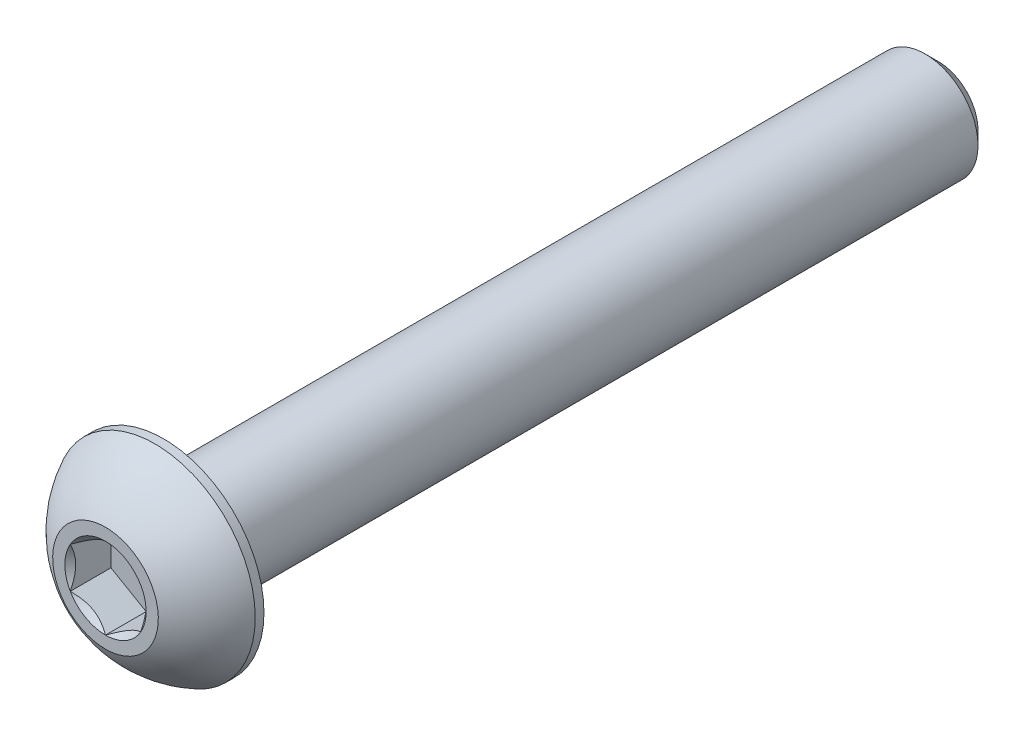
ISO-10303-21;
HEADER;
FILE_DESCRIPTION(('STEP AP214'),'2;1');
FILE_NAME('part.step','',(''),(''),'','','');
FILE_SCHEMA(('AUTOMOTIVE_DESIGN { 1 0 10303 214 1 1 1 1 }'));
ENDSEC;
DATA;
#1=APPLICATION_CONTEXT('core data for automotive mechanical design processes');
#2=APPLICATION_PROTOCOL_DEFINITION('international standard','automotive_design',2000,#1);
#3=PRODUCT_CONTEXT('',#1,'mechanical');
#4=PRODUCT('Part','Part','',(#3));
#5=PRODUCT_RELATED_PRODUCT_CATEGORY('part','',(#4));
#6=PRODUCT_DEFINITION_FORMATION('','',#4);
#7=PRODUCT_DEFINITION_CONTEXT('part definition',#1,'design');
#8=PRODUCT_DEFINITION('design','',#6,#7);
#9=PRODUCT_DEFINITION_SHAPE('','',#8);
#10=(LENGTH_UNIT() NAMED_UNIT(*) SI_UNIT(.MILLI.,.METRE.));
#11=(NAMED_UNIT(*) PLANE_ANGLE_UNIT() SI_UNIT($,.RADIAN.));
#12=(NAMED_UNIT(*) SI_UNIT($,.STERADIAN.) SOLID_ANGLE_UNIT());
#13=UNCERTAINTY_MEASURE_WITH_UNIT(LENGTH_MEASURE(1.E-05),#10,'distance_accuracy_value','');
#14=(GEOMETRIC_REPRESENTATION_CONTEXT(3) GLOBAL_UNCERTAINTY_ASSIGNED_CONTEXT((#13)) GLOBAL_UNIT_ASSIGNED_CONTEXT((#10,
#11,#12)) REPRESENTATION_CONTEXT('',''));
#15=CARTESIAN_POINT('',(0.,0.,0.));
#16=DIRECTION('',(0.,0.,1.));
#17=DIRECTION('',(1.,0.,0.));
#18=AXIS2_PLACEMENT_3D('',#15,#16,#17);
#19=CARTESIAN_POINT('',(0.,-1.5,-23.65));
#20=DIRECTION('',(0.,0.,-1.));
#21=DIRECTION('',(0.,1.,0.));
#22=AXIS2_PLACEMENT_3D('',#19,#20,#21);
#23=PLANE('',#22);
#24=CARTESIAN_POINT('',(0.,0.,-23.65));
#25=DIRECTION('',(0.,0.,-1.));
#26=DIRECTION('',(0.,1.,0.));
#27=AXIS2_PLACEMENT_3D('',#24,#25,#26);
#28=CIRCLE('',#27,1.125);
#29=CARTESIAN_POINT('',(0.,-1.125,-23.65));
#30=VERTEX_POINT('',#29);
#31=EDGE_CURVE('E173',#30,#30,#28,.T.);
#32=ORIENTED_EDGE('',*,*,#31,.T.);
#33=EDGE_LOOP('',(#32));
#34=FACE_BOUND('',#33,.T.);
#35=ADVANCED_FACE('F34',(#34),#23,.T.);
#36=CARTESIAN_POINT('',(0.,0.,-23.65));
#37=DIRECTION('',(0.,0.,-1.));
#38=DIRECTION('',(0.,1.,0.));
#39=AXIS2_PLACEMENT_3D('',#36,#37,#38);
#40=CYLINDRICAL_SURFACE('',#39,1.5);
#41=CARTESIAN_POINT('',(0.,0.,-23.275));
#42=DIRECTION('',(0.,0.,-1.));
#43=DIRECTION('',(0.,1.,0.));
#44=AXIS2_PLACEMENT_3D('',#41,#42,#43);
#45=CIRCLE('',#44,1.5);
#46=CARTESIAN_POINT('',(0.,-1.5,-23.275));
#47=VERTEX_POINT('',#46);
#48=EDGE_CURVE('E47',#47,#47,#45,.F.);
#49=ORIENTED_EDGE('',*,*,#48,.T.);
#50=EDGE_LOOP('',(#49));
#51=FACE_BOUND('',#50,.T.);
#52=CARTESIAN_POINT('',(0.,0.,-1.65));
#53=DIRECTION('',(0.,0.,1.));
#54=DIRECTION('',(1.,0.,0.));
#55=AXIS2_PLACEMENT_3D('',#52,#53,#54);
#56=CIRCLE('',#55,1.5);
#57=CARTESIAN_POINT('',(1.5,0.,-1.65));
#58=VERTEX_POINT('',#57);
#59=EDGE_CURVE('E170',#58,#58,#56,.F.);
#60=ORIENTED_EDGE('',*,*,#59,.T.);
#61=EDGE_LOOP('',(#60));
#62=FACE_BOUND('',#61,.T.);
#63=ADVANCED_FACE('F178',(#51,#62),#40,.T.);
#64=CARTESIAN_POINT('',(0.,0.,-23.65));
#65=DIRECTION('',(0.,0.,1.));
#66=DIRECTION('',(0.,-1.,0.));
#67=AXIS2_PLACEMENT_3D('',#64,#65,#66);
#68=CONICAL_SURFACE('',#67,1.125,0.785398163397452);
#69=CARTESIAN_POINT('',(0.,-1.5,-23.275));
#70=CARTESIAN_POINT('',(0.,-1.49609375,-23.27890625));
#71=CARTESIAN_POINT('',(0.,-1.4921875,-23.2828125));
#72=CARTESIAN_POINT('',(0.,-1.484375,-23.290625));
#73=CARTESIAN_POINT('',(0.,-1.48046875,-23.29453125));
#74=CARTESIAN_POINT('',(0.,-1.47265625,-23.30234375));
#75=CARTESIAN_POINT('',(0.,-1.46875,-23.30625));
#76=CARTESIAN_POINT('',(0.,-1.4609375,-23.3140625));
#77=CARTESIAN_POINT('',(0.,-1.45703125,-23.31796875));
#78=CARTESIAN_POINT('',(0.,-1.44921875,-23.32578125));
#79=CARTESIAN_POINT('',(0.,-1.4453125,-23.3296875));
#80=CARTESIAN_POINT('',(0.,-1.4375,-23.3375));
#81=CARTESIAN_POINT('',(0.,-1.43359375,-23.34140625));
#82=CARTESIAN_POINT('',(0.,-1.42578125,-23.34921875));
#83=CARTESIAN_POINT('',(0.,-1.421875,-23.353125));
#84=CARTESIAN_POINT('',(0.,-1.4140625,-23.3609375));
#85=CARTESIAN_POINT('',(0.,-1.41015625,-23.36484375));
#86=CARTESIAN_POINT('',(0.,-1.40234375,-23.37265625));
#87=CARTESIAN_POINT('',(0.,-1.3984375,-23.3765625));
#88=CARTESIAN_POINT('',(0.,-1.390625,-23.384375));
#89=CARTESIAN_POINT('',(0.,-1.38671875,-23.38828125));
#90=CARTESIAN_POINT('',(0.,-1.37890625,-23.39609375));
#91=CARTESIAN_POINT('',(0.,-1.375,-23.4));
#92=CARTESIAN_POINT('',(0.,-1.3671875,-23.4078125));
#93=CARTESIAN_POINT('',(0.,-1.36328125,-23.41171875));
#94=CARTESIAN_POINT('',(0.,-1.35546875,-23.41953125));
#95=CARTESIAN_POINT('',(0.,-1.3515625,-23.4234375));
#96=CARTESIAN_POINT('',(0.,-1.34375,-23.43125));
#97=CARTESIAN_POINT('',(0.,-1.33984375,-23.43515625));
#98=CARTESIAN_POINT('',(0.,-1.33203125,-23.44296875));
#99=CARTESIAN_POINT('',(0.,-1.328125,-23.446875));
#100=CARTESIAN_POINT('',(0.,-1.3203125,-23.4546875));
#101=CARTESIAN_POINT('',(0.,-1.31640625,-23.45859375));
#102=CARTESIAN_POINT('',(0.,-1.30859375,-23.46640625));
#103=CARTESIAN_POINT('',(0.,-1.3046875,-23.4703125));
#104=CARTESIAN_POINT('',(0.,-1.296875,-23.478125));
#105=CARTESIAN_POINT('',(0.,-1.29296875,-23.48203125));
#106=CARTESIAN_POINT('',(0.,-1.28515625,-23.48984375));
#107=CARTESIAN_POINT('',(0.,-1.28125,-23.49375));
#108=CARTESIAN_POINT('',(0.,-1.2734375,-23.5015625));
#109=CARTESIAN_POINT('',(0.,-1.26953125,-23.50546875));
#110=CARTESIAN_POINT('',(0.,-1.26171875,-23.51328125));
#111=CARTESIAN_POINT('',(0.,-1.2578125,-23.5171875));
#112=CARTESIAN_POINT('',(0.,-1.25,-23.525));
#113=CARTESIAN_POINT('',(0.,-1.24609375,-23.52890625));
#114=CARTESIAN_POINT('',(0.,-1.23828125,-23.53671875));
#115=CARTESIAN_POINT('',(0.,-1.234375,-23.540625));
#116=CARTESIAN_POINT('',(0.,-1.2265625,-23.5484375));
#117=CARTESIAN_POINT('',(0.,-1.22265625,-23.55234375));
#118=CARTESIAN_POINT('',(0.,-1.21484375,-23.56015625));
#119=CARTESIAN_POINT('',(0.,-1.2109375,-23.5640625));
#120=CARTESIAN_POINT('',(0.,-1.203125,-23.571875));
#121=CARTESIAN_POINT('',(0.,-1.19921875,-23.57578125));
#122=CARTESIAN_POINT('',(0.,-1.19140625,-23.58359375));
#123=CARTESIAN_POINT('',(0.,-1.1875,-23.5875));
#124=CARTESIAN_POINT('',(0.,-1.1796875,-23.5953125));
#125=CARTESIAN_POINT('',(0.,-1.17578125,-23.59921875));
#126=CARTESIAN_POINT('',(0.,-1.16796875,-23.60703125));
#127=CARTESIAN_POINT('',(0.,-1.1640625,-23.6109375));
#128=CARTESIAN_POINT('',(0.,-1.15625,-23.61875));
#129=CARTESIAN_POINT('',(0.,-1.15234375,-23.62265625));
#130=CARTESIAN_POINT('',(0.,-1.14453125,-23.63046875));
#131=CARTESIAN_POINT('',(0.,-1.140625,-23.634375));
#132=CARTESIAN_POINT('',(0.,-1.1328125,-23.6421875));
#133=CARTESIAN_POINT('',(0.,-1.12890625,-23.64609375));
#134=CARTESIAN_POINT('',(0.,-1.125,-23.65));
#135=B_SPLINE_CURVE_WITH_KNOTS('',3,(#69,#70,#71,#72,#73,#74,#75,#76,#77,#78,#79,#80,#81,#82,
#83,#84,#85,#86,#87,#88,#89,#90,#91,#92,#93,#94,#95,#96,#97,#98,#99,#100,#101,#102,#103,#104,
#105,#106,#107,#108,#109,#110,#111,#112,#113,#114,#115,#116,#117,#118,#119,#120,#121,#122,#123,
#124,#125,#126,#127,#128,#129,#130,#131,#132,#133,#134),.UNSPECIFIED.,.F.,.F.,(4,2,2,2,2,2,2,2,
2,2,2,2,2,2,2,2,2,2,2,2,2,2,2,2,2,2,2,2,2,2,2,2,4),(0.,0.01657281518406,0.0331456303681199,
0.0497184455521799,0.06629126073624,0.0828640759203,0.09943689110436,0.116009706288418,
0.132582521472477,0.149155336656537,0.165728151840598,0.182300967024658,0.198873782208718,
0.215446597392775,0.232019412576835,0.248592227760895,0.265165042944955,0.281737858129015,
0.298310673313075,0.314883488497135,0.331456303681193,0.348029118865253,0.364601934049313,
0.381174749233373,0.397747564417433,0.414320379601493,0.43089319478555,0.447466009969611,
0.46403882515367,0.48061164033773,0.49718445552179,0.51375727070585,0.530330085889908),.UNSPECIFIED.);
#136=EDGE_CURVE('BSEAM36',#47,#30,#135,.T.);
#137=ORIENTED_EDGE('',*,*,#48,.F.);
#138=ORIENTED_EDGE('',*,*,#31,.F.);
#139=ORIENTED_EDGE('',*,*,#136,.T.);
#140=ORIENTED_EDGE('',*,*,#136,.F.);
#141=EDGE_LOOP('',(#137,#139,#138,#140));
#142=FACE_BOUND('',#141,.T.);
#143=ADVANCED_FACE('F36',(#142),#68,.T.);
#144=CARTESIAN_POINT('',(0.,0.,-2.79483288770053));
#145=DIRECTION('',(0.,0.,1.));
#146=DIRECTION('',(0.,-1.,0.));
#147=AXIS2_PLACEMENT_3D('',#144,#145,#146);
#148=SPHERICAL_SURFACE('',#147,3.17192226735973);
#149=CARTESIAN_POINT('',(0.,0.,0.));
#150=DIRECTION('',(0.,0.,1.));
#151=DIRECTION('',(1.,0.,0.));
#152=AXIS2_PLACEMENT_3D('',#149,#150,#151);
#153=CIRCLE('',#152,1.5);
#154=CARTESIAN_POINT('',(0.,-1.5,0.));
#155=VERTEX_POINT('',#154);
#156=EDGE_CURVE('E167',#155,#155,#153,.T.);
#157=CARTESIAN_POINT('',(0.,0.,-1.4025));
#158=DIRECTION('',(0.,0.,1.));
#159=DIRECTION('',(1.,0.,0.));
#160=AXIS2_PLACEMENT_3D('',#157,#158,#159);
#161=CIRCLE('',#160,2.85);
#162=CARTESIAN_POINT('',(0.,-2.85,-1.4025));
#163=VERTEX_POINT('',#162);
#164=EDGE_CURVE('E161',#163,#163,#161,.T.);
#165=CARTESIAN_POINT('',(0.,-1.5,0.));
#166=CARTESIAN_POINT('',(0.,-1.5181600798921,-0.00974656947336528));
#167=CARTESIAN_POINT('',(0.,-1.53622513742981,-0.0196701847238475));
#168=CARTESIAN_POINT('',(0.,-1.57215840256594,-0.0398676311293121));
#169=CARTESIAN_POINT('',(0.,-1.59002661016438,-0.0501414622842944));
#170=CARTESIAN_POINT('',(0.,-1.6255593701915,-0.0710354648490241));
#171=CARTESIAN_POINT('',(0.,-1.64322392262019,-0.0816556362587714));
#172=CARTESIAN_POINT('',(0.,-1.67834266450262,-0.103238276426967));
#173=CARTESIAN_POINT('',(0.,-1.69579685395636,-0.114200745185416));
#174=CARTESIAN_POINT('',(0.,-1.73048823664554,-0.136463816635606));
#175=CARTESIAN_POINT('',(0.,-1.74772542988099,-0.147764419327347));
#176=CARTESIAN_POINT('',(0.,-1.78197627078176,-0.170699464187153));
#177=CARTESIAN_POINT('',(0.,-1.79898991844709,-0.182333906355219));
#178=CARTESIAN_POINT('',(0.,-1.83278720341135,-0.205932209546912));
#179=CARTESIAN_POINT('',(0.,-1.84957084071028,-0.21789607057054));
#180=CARTESIAN_POINT('',(0.,-1.88290172764636,-0.242148665498754));
#181=CARTESIAN_POINT('',(0.,-1.89944897728351,-0.254437399403341));
#182=CARTESIAN_POINT('',(0.,-1.93230080139369,-0.279335070725423));
#183=CARTESIAN_POINT('',(0.,-1.94860537586673,-0.291944008142919));
#184=CARTESIAN_POINT('',(0.,-1.98096565436365,-0.317477295441111));
#185=CARTESIAN_POINT('',(0.,-1.99702135838753,-0.330401645321807));
#186=CARTESIAN_POINT('',(0.,-2.02887779526297,-0.356560846652225));
#187=CARTESIAN_POINT('',(0.,-2.04467852811452,-0.369795698101948));
#188=CARTESIAN_POINT('',(0.,-2.07601901880464,-0.396570873693307));
#189=CARTESIAN_POINT('',(0.,-2.09155877664321,-0.410111197834942));
#190=CARTESIAN_POINT('',(0.,-2.12237141262985,-0.437492173862106));
#191=CARTESIAN_POINT('',(0.,-2.13764429077792,-0.451332825747633));
#192=CARTESIAN_POINT('',(0.,-2.16791736411296,-0.479309198198268));
#193=CARTESIAN_POINT('',(0.,-2.18291755929993,-0.493444918763374));
#194=CARTESIAN_POINT('',(0.,-2.21263956705415,-0.52200605739095));
#195=CARTESIAN_POINT('',(0.,-2.22736137962139,-0.536431475453418));
#196=CARTESIAN_POINT('',(0.,-2.2565210282552,-0.56556652781647));
#197=CARTESIAN_POINT('',(0.,-2.27095886432178,-0.580276162117054));
#198=CARTESIAN_POINT('',(0.,-2.2995450739765,-0.609974057702794));
#199=CARTESIAN_POINT('',(0.,-2.31369344756465,-0.624962318987951));
#200=CARTESIAN_POINT('',(0.,-2.34169535627252,-0.655211773418758));
#201=CARTESIAN_POINT('',(0.,-2.35554889139224,-0.670472966564409));
#202=CARTESIAN_POINT('',(0.,-2.38295585920366,-0.701262485885582));
#203=CARTESIAN_POINT('',(0.,-2.39650929189537,-0.716790812061104));
#204=CARTESIAN_POINT('',(0.,-2.42331090492182,-0.748108697108241));
#205=CARTESIAN_POINT('',(0.,-2.43655908525656,-0.763898255979857));
#206=CARTESIAN_POINT('',(0.,-2.46274515962755,-0.795732606824226));
#207=CARTESIAN_POINT('',(0.,-2.47568305366379,-0.811777398796979));
#208=CARTESIAN_POINT('',(0.,-2.50124363939651,-0.844116119267125));
#209=CARTESIAN_POINT('',(0.,-2.51386633109298,-0.860410047764518));
#210=CARTESIAN_POINT('',(0.,-2.53879171587278,-0.893240850042598));
#211=CARTESIAN_POINT('',(0.,-2.55109440895612,-0.909777723823286));
#212=CARTESIAN_POINT('',(0.,-2.57537512182785,-0.943088133113639));
#213=CARTESIAN_POINT('',(0.,-2.58735314161625,-0.959861668623304));
#214=CARTESIAN_POINT('',(0.,-2.61097995657956,-0.993639027894245));
#215=CARTESIAN_POINT('',(0.,-2.62262875175448,-1.01064285165552));
#216=CARTESIAN_POINT('',(0.,-2.64559269128198,-1.04487432644225));
#217=CARTESIAN_POINT('',(0.,-2.65690783563458,-1.06210197746771));
#218=CARTESIAN_POINT('',(0.,-2.67920017403639,-1.09677456077299));
#219=CARTESIAN_POINT('',(0.,-2.69017736808561,-1.11421949305282));
#220=CARTESIAN_POINT('',(0.,-2.711789634999,-1.14932001019995));
#221=CARTESIAN_POINT('',(0.,-2.72242470786316,-1.16697559506725));
#222=CARTESIAN_POINT('',(0.,-2.74334869082118,-1.20249070903942));
#223=CARTESIAN_POINT('',(0.,-2.75363760091502,-1.22035023814429));
#224=CARTESIAN_POINT('',(0.,-2.77386535089241,-1.25626645340824));
#225=CARTESIAN_POINT('',(0.,-2.78380419077596,-1.27432313956732));
#226=CARTESIAN_POINT('',(0.,-2.80332801615778,-1.31062681184411));
#227=CARTESIAN_POINT('',(0.,-2.81291300165605,-1.32887379796182));
#228=CARTESIAN_POINT('',(0.,-2.83172550494215,-1.3655511220839));
#229=CARTESIAN_POINT('',(0.,-2.84095302272998,-1.38398146008827));
#230=CARTESIAN_POINT('',(0.,-2.85,-1.4025));
#231=B_SPLINE_CURVE_WITH_KNOTS('',3,(#165,#166,#167,#168,#169,#170,#171,#172,#173,#174,#175,
#176,#177,#178,#179,#180,#181,#182,#183,#184,#185,#186,#187,#188,#189,#190,#191,#192,#193,#194,
#195,#196,#197,#198,#199,#200,#201,#202,#203,#204,#205,#206,#207,#208,#209,#210,#211,#212,#213,
#214,#215,#216,#217,#218,#219,#220,#221,#222,#223,#224,#225,#226,#227,#228,#229,#230),
.UNSPECIFIED.,.F.,.F.,(4,2,2,2,2,2,2,2,2,2,2,2,2,2,2,2,2,2,2,2,2,2,2,2,2,2,2,2,2,2,2,2,4),(0.,
0.0618298941826979,0.123659788365397,0.185489682548095,0.247319576730792,0.309149470913491,
0.370979365096189,0.432809259278888,0.494639153461586,0.556469047644284,0.618298941826982,
0.68012883600968,0.741958730192378,0.803788624375077,0.865618518557775,0.927448412740473,
0.989278306923171,1.05110820110587,1.11293809528857,1.17476798947127,1.23659788365396,
1.29842777783666,1.36025767201936,1.42208756620206,1.48391746038476,1.54574735456745,
1.60757724875015,1.66940714293285,1.73123703711555,1.79306693129825,1.85489682548095,
1.91672671966364,1.97855661384634),.UNSPECIFIED.);
#232=EDGE_CURVE('BSEAM183',#155,#163,#231,.T.);
#233=ORIENTED_EDGE('',*,*,#156,.F.);
#234=ORIENTED_EDGE('',*,*,#164,.T.);
#235=ORIENTED_EDGE('',*,*,#232,.T.);
#236=ORIENTED_EDGE('',*,*,#232,.F.);
#237=EDGE_LOOP('',(#233,#235,#234,#236));
#238=FACE_BOUND('',#237,.T.);
#239=ADVANCED_FACE('F183',(#238),#148,.T.);
#240=CARTESIAN_POINT('',(0.,-1.5,0.));
#241=DIRECTION('',(0.,0.,-1.));
#242=DIRECTION('',(-1.,0.,0.));
#243=AXIS2_PLACEMENT_3D('',#240,#241,#242);
#244=PLANE('',#243);
#245=CARTESIAN_POINT('',(0.,0.,0.));
#246=DIRECTION('',(0.,0.,1.));
#247=DIRECTION('',(1.,0.,0.));
#248=AXIS2_PLACEMENT_3D('',#245,#246,#247);
#249=CIRCLE('',#248,1.15470053837925);
#250=CARTESIAN_POINT('',(-1.,0.577350269189626,0.));
#251=VERTEX_POINT('',#250);
#252=CARTESIAN_POINT('',(-1.,-0.577350269189626,0.));
#253=VERTEX_POINT('',#252);
#254=EDGE_CURVE('E60',#251,#253,#249,.T.);
#255=ORIENTED_EDGE('',*,*,#254,.F.);
#256=CARTESIAN_POINT('',(0.,1.15470053837925,0.));
#257=VERTEX_POINT('',#256);
#258=EDGE_CURVE('E132',#257,#251,#249,.T.);
#259=ORIENTED_EDGE('',*,*,#258,.F.);
#260=CARTESIAN_POINT('',(1.,0.577350269189626,0.));
#261=VERTEX_POINT('',#260);
#262=EDGE_CURVE('E129',#261,#257,#249,.T.);
#263=ORIENTED_EDGE('',*,*,#262,.F.);
#264=CARTESIAN_POINT('',(1.,-0.577350269189626,0.));
#265=VERTEX_POINT('',#264);
#266=EDGE_CURVE('E100',#265,#261,#249,.T.);
#267=ORIENTED_EDGE('',*,*,#266,.F.);
#268=CARTESIAN_POINT('',(0.,-1.15470053837925,0.));
#269=VERTEX_POINT('',#268);
#270=EDGE_CURVE('E92',#269,#265,#249,.T.);
#271=ORIENTED_EDGE('',*,*,#270,.F.);
#272=EDGE_CURVE('E53',#253,#269,#249,.T.);
#273=ORIENTED_EDGE('',*,*,#272,.F.);
#274=EDGE_LOOP('',(#255,#259,#263,#267,#271,#273));
#275=FACE_BOUND('',#274,.T.);
#276=ORIENTED_EDGE('',*,*,#156,.T.);
#277=EDGE_LOOP('',(#276));
#278=FACE_BOUND('',#277,.T.);
#279=ADVANCED_FACE('F126',(#275,#278),#244,.F.);
#280=CARTESIAN_POINT('',(0.,-2.85,-1.65));
#281=DIRECTION('',(0.,0.,1.));
#282=DIRECTION('',(1.,0.,0.));
#283=AXIS2_PLACEMENT_3D('',#280,#281,#282);
#284=PLANE('',#283);
#285=ORIENTED_EDGE('',*,*,#59,.F.);
#286=EDGE_LOOP('',(#285));
#287=FACE_BOUND('',#286,.T.);
#288=CARTESIAN_POINT('',(0.,0.,-1.65));
#289=DIRECTION('',(0.,0.,1.));
#290=DIRECTION('',(1.,0.,0.));
#291=AXIS2_PLACEMENT_3D('',#288,#289,#290);
#292=CIRCLE('',#291,2.85);
#293=CARTESIAN_POINT('',(2.85,0.,-1.65));
#294=VERTEX_POINT('',#293);
#295=EDGE_CURVE('E164',#294,#294,#292,.T.);
#296=ORIENTED_EDGE('',*,*,#295,.F.);
#297=EDGE_LOOP('',(#296));
#298=FACE_BOUND('',#297,.T.);
#299=ADVANCED_FACE('F197',(#287,#298),#284,.F.);
#300=CARTESIAN_POINT('',(0.,0.,0.));
#301=DIRECTION('',(0.,0.,1.));
#302=DIRECTION('',(1.,0.,0.));
#303=AXIS2_PLACEMENT_3D('',#300,#301,#302);
#304=CYLINDRICAL_SURFACE('',#303,2.85);
#305=ORIENTED_EDGE('',*,*,#164,.F.);
#306=EDGE_LOOP('',(#305));
#307=FACE_BOUND('',#306,.T.);
#308=ORIENTED_EDGE('',*,*,#295,.T.);
#309=EDGE_LOOP('',(#308));
#310=FACE_BOUND('',#309,.T.);
#311=ADVANCED_FACE('F200',(#307,#310),#304,.T.);
#312=CARTESIAN_POINT('',(0.,0.,0.));
#313=DIRECTION('',(0.,0.,1.));
#314=DIRECTION('',(1.,0.,0.));
#315=AXIS2_PLACEMENT_3D('',#312,#313,#314);
#316=CONICAL_SURFACE('',#315,1.15470053837925,0.78539816339745);
#317=ORIENTED_EDGE('',*,*,#266,.T.);
#318=CARTESIAN_POINT('',(1.,-1.15147208646462,0.37038567751386));
#319=CARTESIAN_POINT('',(1.,-1.12343447988552,0.349219919873711));
#320=CARTESIAN_POINT('',(1.,-1.09524064850697,0.328261692175909));
#321=CARTESIAN_POINT('',(1.,-1.03847715644376,0.28684602223562));
#322=CARTESIAN_POINT('',(1.,-1.00990740382975,0.266388706123658));
#323=CARTESIAN_POINT('',(1.,-0.923120894333476,0.205604794954508));
#324=CARTESIAN_POINT('',(1.,-0.864253173759059,0.166192228961397));
#325=CARTESIAN_POINT('',(1.,-0.740809858258045,0.0888206642002041));
#326=CARTESIAN_POINT('',(1.,-0.676100255137807,0.0510730391143413));
#327=CARTESIAN_POINT('',(1.,-0.543448939049124,-0.0179754124487091));
#328=CARTESIAN_POINT('',(1.,-0.475519112027778,-0.0492979721531354));
#329=CARTESIAN_POINT('',(1.,-0.373555850333528,-0.0876182211162059));
#330=CARTESIAN_POINT('',(1.,-0.341031989670907,-0.0986164083578445));
#331=CARTESIAN_POINT('',(1.,-0.275199079052293,-0.11800165785264));
#332=CARTESIAN_POINT('',(1.,-0.241889975173933,-0.126388540223302));
#333=CARTESIAN_POINT('',(1.,-0.175247517042992,-0.139974779280984));
#334=CARTESIAN_POINT('',(1.,-0.141925568218174,-0.145229209232033));
#335=CARTESIAN_POINT('',(1.,-0.0749144362322786,-0.152451313429108));
#336=CARTESIAN_POINT('',(1.,-0.0412251978501615,-0.154418486389493));
#337=CARTESIAN_POINT('',(1.,0.0249580992634212,-0.15491680160684));
#338=CARTESIAN_POINT('',(1.,0.0574512826460394,-0.153569732111366));
#339=CARTESIAN_POINT('',(1.,0.122148505701867,-0.147783515501016));
#340=CARTESIAN_POINT('',(1.,0.154352610132927,-0.143345079338465));
#341=CARTESIAN_POINT('',(1.,0.21879989886764,-0.131543169854797));
#342=CARTESIAN_POINT('',(1.,0.251033743268954,-0.124129458961492));
#343=CARTESIAN_POINT('',(1.,0.314797132354919,-0.106771057501325));
#344=CARTESIAN_POINT('',(1.,0.346326735731005,-0.096826578711171));
#345=CARTESIAN_POINT('',(1.,0.445594187730205,-0.061776517445664));
#346=CARTESIAN_POINT('',(1.,0.511919139476037,-0.0326791416432762));
#347=CARTESIAN_POINT('',(1.,0.641453244657532,0.032015329686504));
#348=CARTESIAN_POINT('',(1.,0.704650133126344,0.0676357767152409));
#349=CARTESIAN_POINT('',(1.,0.825428490174987,0.141123901346934));
#350=CARTESIAN_POINT('',(1.,0.883132947867685,0.178791947135463));
#351=CARTESIAN_POINT('',(1.,0.968148853704565,0.237022852943162));
#352=CARTESIAN_POINT('',(1.,0.996120570380285,0.256638475762855));
#353=CARTESIAN_POINT('',(1.,1.05168177729901,0.29638851706127));
#354=CARTESIAN_POINT('',(1.,1.079271369977,0.316522792198831));
#355=CARTESIAN_POINT('',(1.,1.10670185346329,0.336872119072971));
#356=B_SPLINE_CURVE_WITH_KNOTS('',3,(#318,#319,#320,#321,#322,#323,#324,#325,#326,#327,#328,
#329,#330,#331,#332,#333,#334,#335,#336,#337,#338,#339,#340,#341,#342,#343,#344,#345,#346,#347,
#348,#349,#350,#351,#352,#353,#354,#355),.UNSPECIFIED.,.F.,.F.,(4,2,2,2,2,2,2,2,2,2,2,2,2,2,2,2,
2,2,4),(0.,0.105386459083291,0.210799187330124,0.423233611565468,0.647793540908503,
0.871580877738609,0.97449307418142,1.07741235827201,1.17846428203205,1.27953161415762,
1.3769408673961,1.47432772585408,1.57343322804293,1.67253043972851,1.88917353996827,
2.10660791038813,2.31323734249843,2.41572589232044,2.51818641476503),.UNSPECIFIED.);
#357=EDGE_CURVE('E11',#265,#261,#356,.T.);
#358=ORIENTED_EDGE('',*,*,#357,.F.);
#359=EDGE_LOOP('',(#317,#358));
#360=FACE_BOUND('',#359,.T.);
#361=ADVANCED_FACE('F104',(#360),#316,.F.);
#362=ORIENTED_EDGE('',*,*,#262,.T.);
#363=CARTESIAN_POINT('',(1.0002,0.577234799135788,0.00011548737261379));
#364=CARTESIAN_POINT('',(0.965817404992819,0.597085599618622,-0.0197220691742672));
#365=CARTESIAN_POINT('',(0.930859881860175,0.617268335009457,-0.0383949793611113));
#366=CARTESIAN_POINT('',(0.85957719704391,0.658423412276686,-0.0725852572768423));
#367=CARTESIAN_POINT('',(0.823245249471016,0.67939967198808,-0.0880835909765416));
#368=CARTESIAN_POINT('',(0.749983386196689,0.721697428470847,-0.114632692857735));
#369=CARTESIAN_POINT('',(0.713072148554586,0.743008141459637,-0.125750226003074));
#370=CARTESIAN_POINT('',(0.638437270689141,0.786098608286186,-0.142880134223818));
#371=CARTESIAN_POINT('',(0.600715911891364,0.807877044942281,-0.148905302533328));
#372=CARTESIAN_POINT('',(0.535707801582067,0.845409494928863,-0.154339445032507));
#373=CARTESIAN_POINT('',(0.508505628471828,0.861114676896602,-0.155143061683268));
#374=CARTESIAN_POINT('',(0.454153959330888,0.892494627706029,-0.153793300583113));
#375=CARTESIAN_POINT('',(0.427004476245124,0.908169389073954,-0.151639270452801));
#376=CARTESIAN_POINT('',(0.34594372267304,0.954969836969511,-0.140883027871529));
#377=CARTESIAN_POINT('',(0.292435859021573,0.985862616452447,-0.127985443584644));
#378=CARTESIAN_POINT('',(0.198523934856568,1.04008269114923,-0.0968592693978228));
#379=CARTESIAN_POINT('',(0.157679476328165,1.06366425027551,-0.0802622022981607));
#380=CARTESIAN_POINT('',(0.0775903626180559,1.1099037216352,-0.0428750753147074));
#381=CARTESIAN_POINT('',(0.0383409891295618,1.1325643579843,-0.0220986581825969));
#382=CARTESIAN_POINT('',(-0.000200000000000448,1.15481600843309,0.000115487372613952));
#383=B_SPLINE_CURVE_WITH_KNOTS('',3,(#363,#364,#365,#366,#367,#368,#369,#370,#371,#372,#373,
#374,#375,#376,#377,#378,#379,#380,#381,#382),.UNSPECIFIED.,.F.,.F.,(4,2,2,2,2,2,2,2,2,4),(0.,
0.133237676828559,0.26725222983449,0.3991370762693,0.530689603280768,0.624814864263846,
0.718960890149133,0.907306626112097,1.05710100361789,1.20641411519286),.UNSPECIFIED.);
#384=EDGE_CURVE('E131',#261,#257,#383,.T.);
#385=ORIENTED_EDGE('',*,*,#384,.F.);
#386=EDGE_LOOP('',(#362,#385));
#387=FACE_BOUND('',#386,.T.);
#388=ADVANCED_FACE('F280',(#387),#316,.F.);
#389=ORIENTED_EDGE('',*,*,#258,.T.);
#390=CARTESIAN_POINT('',(0.000199999999999653,1.15481600843309,0.000115487372613877));
#391=CARTESIAN_POINT('',(-0.034182595007181,1.13496520795026,-0.0197220691742673));
#392=CARTESIAN_POINT('',(-0.0691401181398251,1.11478247255942,-0.0383949793611114));
#393=CARTESIAN_POINT('',(-0.14042280295609,1.07362739529219,-0.0725852572768422));
#394=CARTESIAN_POINT('',(-0.176754750528985,1.0526511355808,-0.0880835909765414));
#395=CARTESIAN_POINT('',(-0.250016613803312,1.01035337909803,-0.114632692857735));
#396=CARTESIAN_POINT('',(-0.286927851445415,0.989042666109241,-0.125750226003074));
#397=CARTESIAN_POINT('',(-0.36156272931086,0.945952199282691,-0.142880134223818));
#398=CARTESIAN_POINT('',(-0.399284088108636,0.924173762626596,-0.148905302533328));
#399=CARTESIAN_POINT('',(-0.464292198417934,0.886641312640014,-0.154339445032506));
#400=CARTESIAN_POINT('',(-0.491494371528172,0.870936130672275,-0.155143061683268));
#401=CARTESIAN_POINT('',(-0.545846040669112,0.839556179862848,-0.153793300583113));
#402=CARTESIAN_POINT('',(-0.572995523754876,0.823881418494923,-0.151639270452801));
#403=CARTESIAN_POINT('',(-0.65405627732696,0.777080970599367,-0.140883027871529));
#404=CARTESIAN_POINT('',(-0.707564140978428,0.74618819111643,-0.127985443584644));
#405=CARTESIAN_POINT('',(-0.801476065143432,0.691968116419649,-0.096859269397823));
#406=CARTESIAN_POINT('',(-0.842320523671834,0.668386557293371,-0.0802622022981609));
#407=CARTESIAN_POINT('',(-0.922409637381944,0.622147085933681,-0.0428750753147075));
#408=CARTESIAN_POINT('',(-0.961659010870438,0.599486449584575,-0.0220986581825969));
#409=CARTESIAN_POINT('',(-1.0002,0.577234799135788,0.000115487372613623));
#410=B_SPLINE_CURVE_WITH_KNOTS('',3,(#390,#391,#392,#393,#394,#395,#396,#397,#398,#399,#400,
#401,#402,#403,#404,#405,#406,#407,#408,#409),.UNSPECIFIED.,.F.,.F.,(4,2,2,2,2,2,2,2,2,4),(0.,
0.133237676828559,0.26725222983449,0.3991370762693,0.530689603280768,0.624814864263846,
0.718960890149133,0.907306626112098,1.05710100361789,1.20641411519286),.UNSPECIFIED.);
#411=EDGE_CURVE('E136',#257,#251,#410,.T.);
#412=ORIENTED_EDGE('',*,*,#411,.F.);
#413=EDGE_LOOP('',(#389,#412));
#414=FACE_BOUND('',#413,.T.);
#415=ADVANCED_FACE('F139',(#414),#316,.F.);
#416=ORIENTED_EDGE('',*,*,#254,.T.);
#417=CARTESIAN_POINT('',(-1.,-1.15147208646462,0.370385677513861));
#418=CARTESIAN_POINT('',(-1.,-1.12343447988552,0.349219919873711));
#419=CARTESIAN_POINT('',(-1.,-1.09524064850697,0.328261692175909));
#420=CARTESIAN_POINT('',(-1.,-1.03847715644376,0.286846022235621));
#421=CARTESIAN_POINT('',(-1.,-1.00990740382975,0.266388706123658));
#422=CARTESIAN_POINT('',(-1.,-0.923120894333477,0.205604794954509));
#423=CARTESIAN_POINT('',(-1.,-0.86425317375906,0.166192228961397));
#424=CARTESIAN_POINT('',(-1.,-0.740809858258046,0.0888206642002046));
#425=CARTESIAN_POINT('',(-1.,-0.676100255137807,0.0510730391143418));
#426=CARTESIAN_POINT('',(-1.,-0.543448939049125,-0.0179754124487088));
#427=CARTESIAN_POINT('',(-1.,-0.475519112027779,-0.0492979721531352));
#428=CARTESIAN_POINT('',(-1.,-0.373555850333529,-0.0876182211162059));
#429=CARTESIAN_POINT('',(-1.,-0.341031989670908,-0.0986164083578445));
#430=CARTESIAN_POINT('',(-1.,-0.275199079052293,-0.11800165785264));
#431=CARTESIAN_POINT('',(-1.,-0.241889975173933,-0.126388540223302));
#432=CARTESIAN_POINT('',(-1.,-0.175247517042993,-0.139974779280984));
#433=CARTESIAN_POINT('',(-1.,-0.141925568218175,-0.145229209232033));
#434=CARTESIAN_POINT('',(-1.,-0.074914436232279,-0.152451313429108));
#435=CARTESIAN_POINT('',(-1.,-0.0412251978501618,-0.154418486389493));
#436=CARTESIAN_POINT('',(-1.,0.0249580992634209,-0.15491680160684));
#437=CARTESIAN_POINT('',(-1.,0.0574512826460391,-0.153569732111367));
#438=CARTESIAN_POINT('',(-1.,0.122148505701867,-0.147783515501016));
#439=CARTESIAN_POINT('',(-1.,0.154352610132926,-0.143345079338465));
#440=CARTESIAN_POINT('',(-1.,0.21879989886764,-0.131543169854797));
#441=CARTESIAN_POINT('',(-1.,0.251033743268953,-0.124129458961492));
#442=CARTESIAN_POINT('',(-1.,0.314797132354919,-0.106771057501325));
#443=CARTESIAN_POINT('',(-1.,0.346326735731004,-0.0968265787111712));
#444=CARTESIAN_POINT('',(-1.,0.445594187730205,-0.0617765174456643));
#445=CARTESIAN_POINT('',(-1.,0.511919139476036,-0.0326791416432765));
#446=CARTESIAN_POINT('',(-1.,0.641453244657531,0.0320153296865035));
#447=CARTESIAN_POINT('',(-1.,0.704650133126343,0.0676357767152402));
#448=CARTESIAN_POINT('',(-1.,0.825428490174986,0.141123901346934));
#449=CARTESIAN_POINT('',(-1.,0.883132947867684,0.178791947135462));
#450=CARTESIAN_POINT('',(-1.,0.968148853704564,0.237022852943162));
#451=CARTESIAN_POINT('',(-1.,0.996120570380284,0.256638475762855));
#452=CARTESIAN_POINT('',(-1.,1.05168177729901,0.296388517061269));
#453=CARTESIAN_POINT('',(-1.,1.079271369977,0.31652279219883));
#454=CARTESIAN_POINT('',(-1.,1.10670185346329,0.33687211907297));
#455=B_SPLINE_CURVE_WITH_KNOTS('',3,(#417,#418,#419,#420,#421,#422,#423,#424,#425,#426,#427,
#428,#429,#430,#431,#432,#433,#434,#435,#436,#437,#438,#439,#440,#441,#442,#443,#444,#445,#446,
#447,#448,#449,#450,#451,#452,#453,#454),.UNSPECIFIED.,.F.,.F.,(4,2,2,2,2,2,2,2,2,2,2,2,2,2,2,2,
2,2,4),(0.,0.105386459083291,0.210799187330125,0.423233611565469,0.647793540908503,
0.87158087773861,0.974493074181421,1.07741235827201,1.17846428203205,1.27953161415762,
1.3769408673961,1.47432772585408,1.57343322804293,1.67253043972851,1.88917353996827,
2.10660791038813,2.31323734249843,2.41572589232044,2.51818641476503),.UNSPECIFIED.);
#456=EDGE_CURVE('E143',#251,#253,#455,.F.);
#457=ORIENTED_EDGE('',*,*,#456,.F.);
#458=EDGE_LOOP('',(#416,#457));
#459=FACE_BOUND('',#458,.T.);
#460=ADVANCED_FACE('F274',(#459),#316,.F.);
#461=ORIENTED_EDGE('',*,*,#272,.T.);
#462=CARTESIAN_POINT('',(-1.0002,-0.577234799135788,0.00011548737261379));
#463=CARTESIAN_POINT('',(-0.965817404992819,-0.597085599618622,-0.0197220691742671));
#464=CARTESIAN_POINT('',(-0.930859881860175,-0.617268335009456,-0.0383949793611112));
#465=CARTESIAN_POINT('',(-0.85957719704391,-0.658423412276686,-0.0725852572768422));
#466=CARTESIAN_POINT('',(-0.823245249471016,-0.67939967198808,-0.0880835909765416));
#467=CARTESIAN_POINT('',(-0.749983386196689,-0.721697428470847,-0.114632692857735));
#468=CARTESIAN_POINT('',(-0.713072148554586,-0.743008141459637,-0.125750226003074));
#469=CARTESIAN_POINT('',(-0.638437270689141,-0.786098608286186,-0.142880134223818));
#470=CARTESIAN_POINT('',(-0.600715911891364,-0.807877044942281,-0.148905302533327));
#471=CARTESIAN_POINT('',(-0.535707801582066,-0.845409494928863,-0.154339445032506));
#472=CARTESIAN_POINT('',(-0.508505628471828,-0.861114676896602,-0.155143061683268));
#473=CARTESIAN_POINT('',(-0.454153959330888,-0.892494627706029,-0.153793300583113));
#474=CARTESIAN_POINT('',(-0.427004476245124,-0.908169389073954,-0.151639270452801));
#475=CARTESIAN_POINT('',(-0.34594372267304,-0.954969836969511,-0.140883027871529));
#476=CARTESIAN_POINT('',(-0.292435859021572,-0.985862616452447,-0.127985443584644));
#477=CARTESIAN_POINT('',(-0.198523934856568,-1.04008269114923,-0.0968592693978226));
#478=CARTESIAN_POINT('',(-0.157679476328166,-1.06366425027551,-0.0802622022981606));
#479=CARTESIAN_POINT('',(-0.0775903626180561,-1.1099037216352,-0.0428750753147073));
#480=CARTESIAN_POINT('',(-0.038340989129562,-1.1325643579843,-0.0220986581825967));
#481=CARTESIAN_POINT('',(0.000200000000000127,-1.15481600843309,0.000115487372614116));
#482=B_SPLINE_CURVE_WITH_KNOTS('',3,(#462,#463,#464,#465,#466,#467,#468,#469,#470,#471,#472,
#473,#474,#475,#476,#477,#478,#479,#480,#481),.UNSPECIFIED.,.F.,.F.,(4,2,2,2,2,2,2,2,2,4),(0.,
0.133237676828559,0.26725222983449,0.3991370762693,0.530689603280768,0.624814864263846,
0.718960890149133,0.907306626112098,1.05710100361789,1.20641411519286),.UNSPECIFIED.);
#483=EDGE_CURVE('E116',#253,#269,#482,.T.);
#484=ORIENTED_EDGE('',*,*,#483,.F.);
#485=EDGE_LOOP('',(#461,#484));
#486=FACE_BOUND('',#485,.T.);
#487=ADVANCED_FACE('F225',(#486),#316,.F.);
#488=ORIENTED_EDGE('',*,*,#270,.T.);
#489=CARTESIAN_POINT('',(-0.000199999999999753,-1.15481600843309,0.000115487372614094));
#490=CARTESIAN_POINT('',(0.0341825950071809,-1.13496520795026,-0.019722069174267));
#491=CARTESIAN_POINT('',(0.0691401181398251,-1.11478247255942,-0.0383949793611112));
#492=CARTESIAN_POINT('',(0.14042280295609,-1.07362739529219,-0.0725852572768422));
#493=CARTESIAN_POINT('',(0.176754750528984,-1.0526511355808,-0.0880835909765414));
#494=CARTESIAN_POINT('',(0.250016613803311,-1.01035337909803,-0.114632692857735));
#495=CARTESIAN_POINT('',(0.286927851445415,-0.989042666109241,-0.125750226003074));
#496=CARTESIAN_POINT('',(0.36156272931086,-0.945952199282691,-0.142880134223818));
#497=CARTESIAN_POINT('',(0.399284088108636,-0.924173762626596,-0.148905302533327));
#498=CARTESIAN_POINT('',(0.464292198417934,-0.886641312640014,-0.154339445032506));
#499=CARTESIAN_POINT('',(0.491494371528173,-0.870936130672275,-0.155143061683268));
#500=CARTESIAN_POINT('',(0.545846040669112,-0.839556179862848,-0.153793300583113));
#501=CARTESIAN_POINT('',(0.572995523754876,-0.823881418494923,-0.151639270452801));
#502=CARTESIAN_POINT('',(0.65405627732696,-0.777080970599366,-0.140883027871529));
#503=CARTESIAN_POINT('',(0.707564140978428,-0.74618819111643,-0.127985443584644));
#504=CARTESIAN_POINT('',(0.801476065143432,-0.691968116419649,-0.0968592693978231));
#505=CARTESIAN_POINT('',(0.842320523671835,-0.668386557293371,-0.0802622022981609));
#506=CARTESIAN_POINT('',(0.922409637381944,-0.622147085933681,-0.0428750753147075));
#507=CARTESIAN_POINT('',(0.961659010870438,-0.599486449584575,-0.022098658182597));
#508=CARTESIAN_POINT('',(1.0002,-0.577234799135788,0.000115487372613542));
#509=B_SPLINE_CURVE_WITH_KNOTS('',3,(#489,#490,#491,#492,#493,#494,#495,#496,#497,#498,#499,
#500,#501,#502,#503,#504,#505,#506,#507,#508),.UNSPECIFIED.,.F.,.F.,(4,2,2,2,2,2,2,2,2,4),(0.,
0.133237676828559,0.26725222983449,0.3991370762693,0.530689603280769,0.624814864263847,
0.718960890149133,0.907306626112098,1.05710100361789,1.20641411519286),.UNSPECIFIED.);
#510=EDGE_CURVE('E96',#269,#265,#509,.T.);
#511=ORIENTED_EDGE('',*,*,#510,.F.);
#512=EDGE_LOOP('',(#488,#511));
#513=FACE_BOUND('',#512,.T.);
#514=ADVANCED_FACE('F94',(#513),#316,.F.);
#515=CARTESIAN_POINT('',(1.,-0.577350269189626,-1.155));
#516=DIRECTION('',(0.,0.,1.));
#517=DIRECTION('',(1.,0.,0.));
#518=AXIS2_PLACEMENT_3D('',#515,#516,#517);
#519=PLANE('',#518);
#520=DIRECTION('',(0.866025403784438,0.500000000000001,0.));
#521=VECTOR('',#520,1.);
#522=CARTESIAN_POINT('',(0.,-1.15470053837925,-1.155));
#523=LINE('',#522,#521);
#524=CARTESIAN_POINT('',(0.,-1.15470053837925,-1.155));
#525=VERTEX_POINT('',#524);
#526=CARTESIAN_POINT('',(1.,-0.577350269189626,-1.155));
#527=VERTEX_POINT('',#526);
#528=EDGE_CURVE('E115',#525,#527,#523,.T.);
#529=ORIENTED_EDGE('',*,*,#528,.T.);
#530=DIRECTION('',(0.,1.,0.));
#531=VECTOR('',#530,1.);
#532=CARTESIAN_POINT('',(1.,-0.577350269189626,-1.155));
#533=LINE('',#532,#531);
#534=CARTESIAN_POINT('',(1.,0.577350269189626,-1.155));
#535=VERTEX_POINT('',#534);
#536=EDGE_CURVE('E120',#527,#535,#533,.T.);
#537=ORIENTED_EDGE('',*,*,#536,.T.);
#538=DIRECTION('',(-0.866025403784439,0.5,0.));
#539=VECTOR('',#538,1.);
#540=CARTESIAN_POINT('',(1.,0.577350269189626,-1.155));
#541=LINE('',#540,#539);
#542=CARTESIAN_POINT('',(0.,1.15470053837925,-1.155));
#543=VERTEX_POINT('',#542);
#544=EDGE_CURVE('E264',#535,#543,#541,.T.);
#545=ORIENTED_EDGE('',*,*,#544,.T.);
#546=DIRECTION('',(-0.866025403784438,-0.5,0.));
#547=VECTOR('',#546,1.);
#548=CARTESIAN_POINT('',(0.,1.15470053837925,-1.155));
#549=LINE('',#548,#547);
#550=CARTESIAN_POINT('',(-1.,0.577350269189626,-1.155));
#551=VERTEX_POINT('',#550);
#552=EDGE_CURVE('E152',#543,#551,#549,.T.);
#553=ORIENTED_EDGE('',*,*,#552,.T.);
#554=DIRECTION('',(0.,-1.,0.));
#555=VECTOR('',#554,1.);
#556=CARTESIAN_POINT('',(-1.,0.577350269189626,-1.155));
#557=LINE('',#556,#555);
#558=CARTESIAN_POINT('',(-1.,-0.577350269189626,-1.155));
#559=VERTEX_POINT('',#558);
#560=EDGE_CURVE('E268',#551,#559,#557,.T.);
#561=ORIENTED_EDGE('',*,*,#560,.T.);
#562=DIRECTION('',(0.866025403784439,-0.5,0.));
#563=VECTOR('',#562,1.);
#564=CARTESIAN_POINT('',(-1.,-0.577350269189626,-1.155));
#565=LINE('',#564,#563);
#566=EDGE_CURVE('E123',#559,#525,#565,.T.);
#567=ORIENTED_EDGE('',*,*,#566,.T.);
#568=EDGE_LOOP('',(#529,#537,#545,#553,#561,#567));
#569=FACE_BOUND('',#568,.T.);
#570=ADVANCED_FACE('F224',(#569),#519,.T.);
#571=CARTESIAN_POINT('',(1.,-0.577350269189626,-1.155));
#572=DIRECTION('',(1.,0.,0.));
#573=DIRECTION('',(0.,0.,-1.));
#574=AXIS2_PLACEMENT_3D('',#571,#572,#573);
#575=PLANE('',#574);
#576=DIRECTION('',(0.,0.,1.));
#577=VECTOR('',#576,1.);
#578=CARTESIAN_POINT('',(1.,-0.577350269189626,-1.155));
#579=LINE('',#578,#577);
#580=EDGE_CURVE('E112',#527,#265,#579,.T.);
#581=ORIENTED_EDGE('',*,*,#580,.T.);
#582=ORIENTED_EDGE('',*,*,#357,.T.);
#583=DIRECTION('',(0.,0.,1.));
#584=VECTOR('',#583,1.);
#585=CARTESIAN_POINT('',(1.,0.577350269189626,-1.155));
#586=LINE('',#585,#584);
#587=EDGE_CURVE('E122',#535,#261,#586,.T.);
#588=ORIENTED_EDGE('',*,*,#587,.F.);
#589=ORIENTED_EDGE('',*,*,#536,.F.);
#590=EDGE_LOOP('',(#581,#582,#588,#589));
#591=FACE_BOUND('',#590,.T.);
#592=ADVANCED_FACE('F118',(#591),#575,.F.);
#593=CARTESIAN_POINT('',(1.,0.577350269189626,-1.155));
#594=DIRECTION('',(0.5,0.866025403784439,0.));
#595=DIRECTION('',(-0.866025403784439,0.5,0.));
#596=AXIS2_PLACEMENT_3D('',#593,#594,#595);
#597=PLANE('',#596);
#598=ORIENTED_EDGE('',*,*,#587,.T.);
#599=ORIENTED_EDGE('',*,*,#384,.T.);
#600=DIRECTION('',(0.,0.,1.));
#601=VECTOR('',#600,1.);
#602=CARTESIAN_POINT('',(0.,1.15470053837925,-1.155));
#603=LINE('',#602,#601);
#604=EDGE_CURVE('E148',#543,#257,#603,.T.);
#605=ORIENTED_EDGE('',*,*,#604,.F.);
#606=ORIENTED_EDGE('',*,*,#544,.F.);
#607=EDGE_LOOP('',(#598,#599,#605,#606));
#608=FACE_BOUND('',#607,.T.);
#609=ADVANCED_FACE('F146',(#608),#597,.F.);
#610=CARTESIAN_POINT('',(0.,1.15470053837925,-1.155));
#611=DIRECTION('',(-0.5,0.866025403784438,0.));
#612=DIRECTION('',(-0.866025403784439,-0.5,0.));
#613=AXIS2_PLACEMENT_3D('',#610,#611,#612);
#614=PLANE('',#613);
#615=ORIENTED_EDGE('',*,*,#604,.T.);
#616=ORIENTED_EDGE('',*,*,#411,.T.);
#617=DIRECTION('',(0.,0.,1.));
#618=VECTOR('',#617,1.);
#619=CARTESIAN_POINT('',(-1.,0.577350269189626,-1.155));
#620=LINE('',#619,#618);
#621=EDGE_CURVE('E154',#551,#251,#620,.T.);
#622=ORIENTED_EDGE('',*,*,#621,.F.);
#623=ORIENTED_EDGE('',*,*,#552,.F.);
#624=EDGE_LOOP('',(#615,#616,#622,#623));
#625=FACE_BOUND('',#624,.T.);
#626=ADVANCED_FACE('F150',(#625),#614,.F.);
#627=CARTESIAN_POINT('',(-1.,0.577350269189626,-1.155));
#628=DIRECTION('',(-1.,0.,0.));
#629=DIRECTION('',(0.,0.,1.));
#630=AXIS2_PLACEMENT_3D('',#627,#628,#629);
#631=PLANE('',#630);
#632=ORIENTED_EDGE('',*,*,#621,.T.);
#633=ORIENTED_EDGE('',*,*,#456,.T.);
#634=DIRECTION('',(0.,0.,1.));
#635=VECTOR('',#634,1.);
#636=CARTESIAN_POINT('',(-1.,-0.577350269189626,-1.155));
#637=LINE('',#636,#635);
#638=EDGE_CURVE('E156',#559,#253,#637,.T.);
#639=ORIENTED_EDGE('',*,*,#638,.F.);
#640=ORIENTED_EDGE('',*,*,#560,.F.);
#641=EDGE_LOOP('',(#632,#633,#639,#640));
#642=FACE_BOUND('',#641,.T.);
#643=ADVANCED_FACE('F243',(#642),#631,.F.);
#644=CARTESIAN_POINT('',(-1.,-0.577350269189626,-1.155));
#645=DIRECTION('',(-0.5,-0.866025403784439,0.));
#646=DIRECTION('',(0.866025403784439,-0.5,0.));
#647=AXIS2_PLACEMENT_3D('',#644,#645,#646);
#648=PLANE('',#647);
#649=ORIENTED_EDGE('',*,*,#638,.T.);
#650=ORIENTED_EDGE('',*,*,#483,.T.);
#651=DIRECTION('',(0.,0.,1.));
#652=VECTOR('',#651,1.);
#653=CARTESIAN_POINT('',(0.,-1.15470053837925,-1.155));
#654=LINE('',#653,#652);
#655=EDGE_CURVE('E114',#525,#269,#654,.T.);
#656=ORIENTED_EDGE('',*,*,#655,.F.);
#657=ORIENTED_EDGE('',*,*,#566,.F.);
#658=EDGE_LOOP('',(#649,#650,#656,#657));
#659=FACE_BOUND('',#658,.T.);
#660=ADVANCED_FACE('F207',(#659),#648,.F.);
#661=CARTESIAN_POINT('',(0.,-1.15470053837925,-1.155));
#662=DIRECTION('',(0.500000000000001,-0.866025403784438,0.));
#663=DIRECTION('',(0.866025403784438,0.500000000000001,0.));
#664=AXIS2_PLACEMENT_3D('',#661,#662,#663);
#665=PLANE('',#664);
#666=ORIENTED_EDGE('',*,*,#655,.T.);
#667=ORIENTED_EDGE('',*,*,#510,.T.);
#668=ORIENTED_EDGE('',*,*,#580,.F.);
#669=ORIENTED_EDGE('',*,*,#528,.F.);
#670=EDGE_LOOP('',(#666,#667,#668,#669));
#671=FACE_BOUND('',#670,.T.);
#672=ADVANCED_FACE('F110',(#671),#665,.F.);
#673=CLOSED_SHELL('',(#35,#63,#143,#239,#279,#299,#311,#361,#388,#415,#460,#487,#514,#570,#592,
#609,#626,#643,#660,#672));
#674=MANIFOLD_SOLID_BREP('B2',#673);
#675=ADVANCED_BREP_SHAPE_REPRESENTATION('',(#18,#674),#14);
#676=SHAPE_DEFINITION_REPRESENTATION(#9,#675);
ENDSEC;
END-ISO-10303-21;
